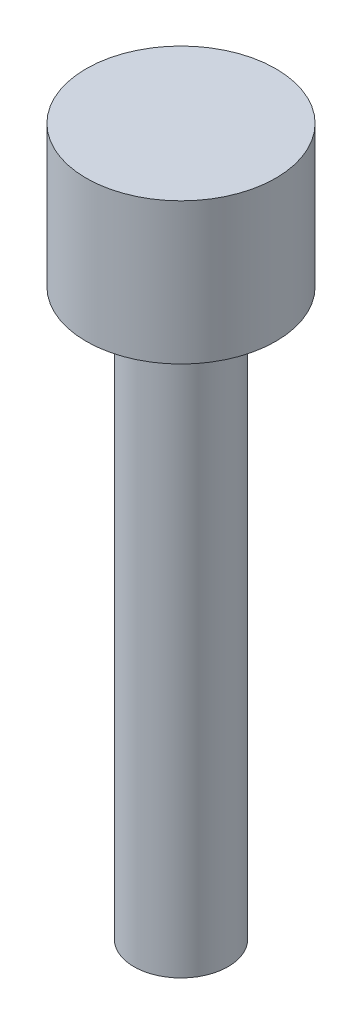
ISO-10303-21;
HEADER;
FILE_DESCRIPTION(('STEP AP214'),'2;1');
FILE_NAME('part.step','',(''),(''),'','','');
FILE_SCHEMA(('AUTOMOTIVE_DESIGN { 1 0 10303 214 1 1 1 1 }'));
ENDSEC;
DATA;
#1=APPLICATION_CONTEXT('core data for automotive mechanical design processes');
#2=APPLICATION_PROTOCOL_DEFINITION('international standard','automotive_design',2000,#1);
#3=PRODUCT_CONTEXT('',#1,'mechanical');
#4=PRODUCT('Part','Part','',(#3));
#5=PRODUCT_RELATED_PRODUCT_CATEGORY('part','',(#4));
#6=PRODUCT_DEFINITION_FORMATION('','',#4);
#7=PRODUCT_DEFINITION_CONTEXT('part definition',#1,'design');
#8=PRODUCT_DEFINITION('design','',#6,#7);
#9=PRODUCT_DEFINITION_SHAPE('','',#8);
#10=(LENGTH_UNIT() NAMED_UNIT(*) SI_UNIT(.MILLI.,.METRE.));
#11=(NAMED_UNIT(*) PLANE_ANGLE_UNIT() SI_UNIT($,.RADIAN.));
#12=(NAMED_UNIT(*) SI_UNIT($,.STERADIAN.) SOLID_ANGLE_UNIT());
#13=UNCERTAINTY_MEASURE_WITH_UNIT(LENGTH_MEASURE(1.E-05),#10,'distance_accuracy_value','');
#14=(GEOMETRIC_REPRESENTATION_CONTEXT(3) GLOBAL_UNCERTAINTY_ASSIGNED_CONTEXT((#13)) GLOBAL_UNIT_ASSIGNED_CONTEXT((#10,
#11,#12)) REPRESENTATION_CONTEXT('',''));
#15=CARTESIAN_POINT('',(0.,0.,0.));
#16=DIRECTION('',(0.,0.,1.));
#17=DIRECTION('',(1.,0.,0.));
#18=AXIS2_PLACEMENT_3D('',#15,#16,#17);
#19=CARTESIAN_POINT('',(1.,0.,0.));
#20=DIRECTION('',(0.,-1.,0.));
#21=DIRECTION('',(0.,0.,-1.));
#22=AXIS2_PLACEMENT_3D('',#19,#20,#21);
#23=PLANE('',#22);
#24=CARTESIAN_POINT('',(0.,0.,0.));
#25=DIRECTION('',(0.,-1.,0.));
#26=DIRECTION('',(0.,0.,-1.));
#27=AXIS2_PLACEMENT_3D('',#24,#25,#26);
#28=CIRCLE('',#27,1.);
#29=CARTESIAN_POINT('',(0.,0.,-1.));
#30=VERTEX_POINT('',#29);
#31=EDGE_CURVE('E54',#30,#30,#28,.T.);
#32=ORIENTED_EDGE('',*,*,#31,.T.);
#33=EDGE_LOOP('',(#32));
#34=FACE_BOUND('',#33,.T.);
#35=ADVANCED_FACE('F37',(#34),#23,.T.);
#36=CARTESIAN_POINT('',(0.,15.,0.));
#37=DIRECTION('',(0.,1.,0.));
#38=DIRECTION('',(0.,0.,1.));
#39=AXIS2_PLACEMENT_3D('',#36,#37,#38);
#40=PLANE('',#39);
#41=CARTESIAN_POINT('',(0.,15.,0.));
#42=DIRECTION('',(0.,-1.,0.));
#43=DIRECTION('',(0.,0.,-1.));
#44=AXIS2_PLACEMENT_3D('',#41,#42,#43);
#45=CIRCLE('',#44,2.01258507258943);
#46=CARTESIAN_POINT('',(0.,15.,-2.01258507258943));
#47=VERTEX_POINT('',#46);
#48=EDGE_CURVE('E10',#47,#47,#45,.T.);
#49=ORIENTED_EDGE('',*,*,#48,.F.);
#50=EDGE_LOOP('',(#49));
#51=FACE_BOUND('',#50,.T.);
#52=ADVANCED_FACE('F73',(#51),#40,.T.);
#53=CARTESIAN_POINT('',(0.,0.,0.));
#54=DIRECTION('',(0.,-1.,0.));
#55=DIRECTION('',(0.,0.,-1.));
#56=AXIS2_PLACEMENT_3D('',#53,#54,#55);
#57=CYLINDRICAL_SURFACE('',#56,2.01258507258943);
#58=ORIENTED_EDGE('',*,*,#48,.T.);
#59=EDGE_LOOP('',(#58));
#60=FACE_BOUND('',#59,.T.);
#61=CARTESIAN_POINT('',(0.,12.,0.));
#62=DIRECTION('',(0.,-1.,0.));
#63=DIRECTION('',(0.,0.,-1.));
#64=AXIS2_PLACEMENT_3D('',#61,#62,#63);
#65=CIRCLE('',#64,2.01258507258943);
#66=CARTESIAN_POINT('',(0.,12.,-2.01258507258943));
#67=VERTEX_POINT('',#66);
#68=EDGE_CURVE('E44',#67,#67,#65,.T.);
#69=ORIENTED_EDGE('',*,*,#68,.F.);
#70=EDGE_LOOP('',(#69));
#71=FACE_BOUND('',#70,.T.);
#72=ADVANCED_FACE('F70',(#60,#71),#57,.T.);
#73=CARTESIAN_POINT('',(2.01258507258943,12.,0.));
#74=DIRECTION('',(0.,-1.,0.));
#75=DIRECTION('',(0.,0.,-1.));
#76=AXIS2_PLACEMENT_3D('',#73,#74,#75);
#77=PLANE('',#76);
#78=ORIENTED_EDGE('',*,*,#68,.T.);
#79=EDGE_LOOP('',(#78));
#80=FACE_BOUND('',#79,.T.);
#81=CARTESIAN_POINT('',(0.,12.,0.));
#82=DIRECTION('',(0.,-1.,0.));
#83=DIRECTION('',(0.,0.,-1.));
#84=AXIS2_PLACEMENT_3D('',#81,#82,#83);
#85=CIRCLE('',#84,0.999999999999999);
#86=CARTESIAN_POINT('',(0.,12.,-0.999999999999999));
#87=VERTEX_POINT('',#86);
#88=EDGE_CURVE('E49',#87,#87,#85,.T.);
#89=ORIENTED_EDGE('',*,*,#88,.F.);
#90=EDGE_LOOP('',(#89));
#91=FACE_BOUND('',#90,.T.);
#92=ADVANCED_FACE('F64',(#80,#91),#77,.T.);
#93=CARTESIAN_POINT('',(0.,0.,0.));
#94=DIRECTION('',(0.,-1.,0.));
#95=DIRECTION('',(0.,0.,-1.));
#96=AXIS2_PLACEMENT_3D('',#93,#94,#95);
#97=CYLINDRICAL_SURFACE('',#96,1.);
#98=ORIENTED_EDGE('',*,*,#88,.T.);
#99=EDGE_LOOP('',(#98));
#100=FACE_BOUND('',#99,.T.);
#101=ORIENTED_EDGE('',*,*,#31,.F.);
#102=EDGE_LOOP('',(#101));
#103=FACE_BOUND('',#102,.T.);
#104=ADVANCED_FACE('F62',(#100,#103),#97,.T.);
#105=CLOSED_SHELL('',(#35,#52,#72,#92,#104));
#106=MANIFOLD_SOLID_BREP('B2',#105);
#107=ADVANCED_BREP_SHAPE_REPRESENTATION('',(#18,#106),#14);
#108=SHAPE_DEFINITION_REPRESENTATION(#9,#107);
ENDSEC;
END-ISO-10303-21;
